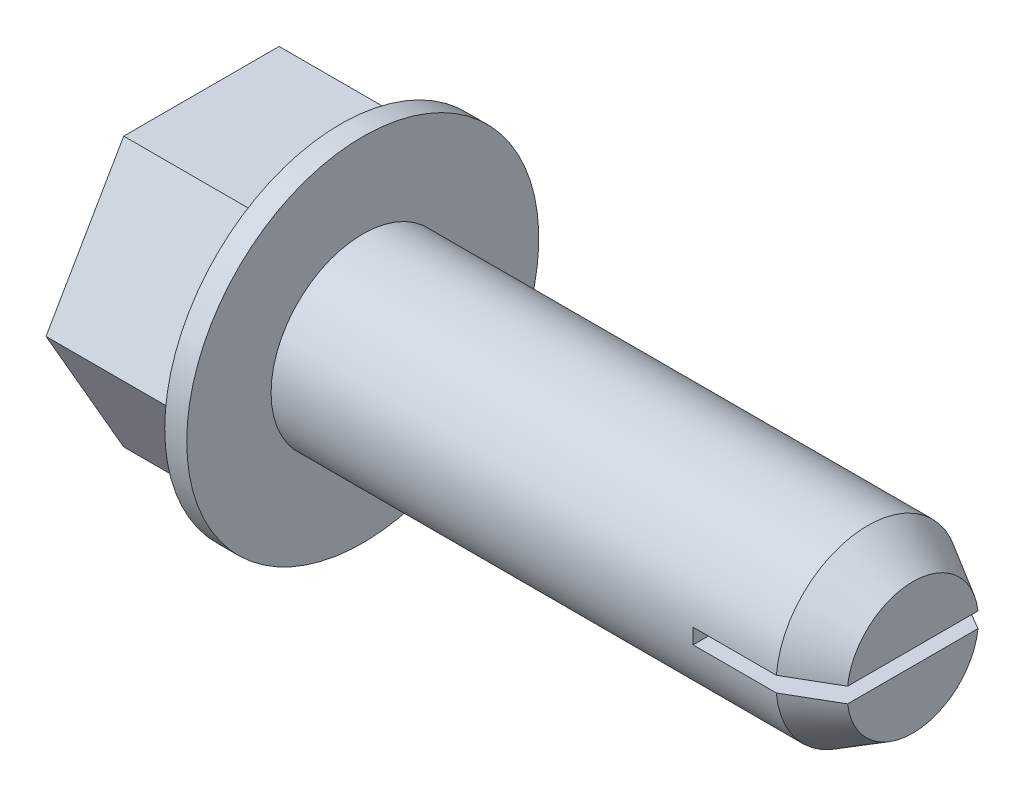
ISO-10303-21;
HEADER;
FILE_DESCRIPTION(('STEP AP214'),'2;1');
FILE_NAME('part.step','',(''),(''),'','','');
FILE_SCHEMA(('AUTOMOTIVE_DESIGN { 1 0 10303 214 1 1 1 1 }'));
ENDSEC;
DATA;
#1=APPLICATION_CONTEXT('core data for automotive mechanical design processes');
#2=APPLICATION_PROTOCOL_DEFINITION('international standard','automotive_design',2000,#1);
#3=PRODUCT_CONTEXT('',#1,'mechanical');
#4=PRODUCT('Part','Part','',(#3));
#5=PRODUCT_RELATED_PRODUCT_CATEGORY('part','',(#4));
#6=PRODUCT_DEFINITION_FORMATION('','',#4);
#7=PRODUCT_DEFINITION_CONTEXT('part definition',#1,'design');
#8=PRODUCT_DEFINITION('design','',#6,#7);
#9=PRODUCT_DEFINITION_SHAPE('','',#8);
#10=(LENGTH_UNIT() NAMED_UNIT(*) SI_UNIT(.MILLI.,.METRE.));
#11=(NAMED_UNIT(*) PLANE_ANGLE_UNIT() SI_UNIT($,.RADIAN.));
#12=(NAMED_UNIT(*) SI_UNIT($,.STERADIAN.) SOLID_ANGLE_UNIT());
#13=UNCERTAINTY_MEASURE_WITH_UNIT(LENGTH_MEASURE(1.E-05),#10,'distance_accuracy_value','');
#14=(GEOMETRIC_REPRESENTATION_CONTEXT(3) GLOBAL_UNCERTAINTY_ASSIGNED_CONTEXT((#13)) GLOBAL_UNIT_ASSIGNED_CONTEXT((#10,
#11,#12)) REPRESENTATION_CONTEXT('',''));
#15=CARTESIAN_POINT('',(0.,0.,0.));
#16=DIRECTION('',(0.,0.,1.));
#17=DIRECTION('',(1.,0.,0.));
#18=AXIS2_PLACEMENT_3D('',#15,#16,#17);
#19=CARTESIAN_POINT('',(14.605,-0.264583333333334,-6.096));
#20=DIRECTION('',(0.,-1.,0.));
#21=DIRECTION('',(0.,0.,-1.));
#22=AXIS2_PLACEMENT_3D('',#19,#20,#21);
#23=PLANE('',#22);
#24=CARTESIAN_POINT('',(17.4882097868151,-0.264583333333334,3.16395648827891));
#25=CARTESIAN_POINT('',(18.0089885370992,-0.264583333333334,2.86223526832155));
#26=CARTESIAN_POINT('',(18.5296581049854,-0.264583333333334,2.56032561142075));
#27=CARTESIAN_POINT('',(19.05,-0.264583333333334,2.25785042678257));
#28=B_SPLINE_CURVE_WITH_KNOTS('',3,(#24,#25,#26,#27),.UNSPECIFIED.,.F.,.F.,(4,4),
(0.00453305455754315,0.0063386613276139),.UNSPECIFIED.);
#29=CARTESIAN_POINT('',(17.4882097868151,-0.264583333333334,3.16395648827891));
#30=VERTEX_POINT('',#29);
#31=CARTESIAN_POINT('',(19.05,-0.264583333333334,2.25785042678257));
#32=VERTEX_POINT('',#31);
#33=EDGE_CURVE('E277',#30,#32,#28,.T.);
#34=ORIENTED_EDGE('',*,*,#33,.T.);
#35=DIRECTION('',(0.,0.,1.));
#36=VECTOR('',#35,1.);
#37=CARTESIAN_POINT('',(19.05,-0.264583333333334,0.));
#38=LINE('',#37,#36);
#39=CARTESIAN_POINT('',(19.05,-0.264583333333334,-2.25785042678257));
#40=VERTEX_POINT('',#39);
#41=EDGE_CURVE('E43',#40,#32,#38,.T.);
#42=ORIENTED_EDGE('',*,*,#41,.F.);
#43=CARTESIAN_POINT('',(19.05,-0.264583333333334,-2.25785042678257));
#44=CARTESIAN_POINT('',(18.5296592052055,-0.264583333333334,-2.56032497186193));
#45=CARTESIAN_POINT('',(18.0089893235556,-0.264583333333334,-2.86223481267582));
#46=CARTESIAN_POINT('',(17.4882097868151,-0.264583333333334,-3.16395648827891));
#47=B_SPLINE_CURVE_WITH_KNOTS('',3,(#43,#44,#45,#46),.UNSPECIFIED.,.F.,.F.,(4,4),
(0.0147270207009754,0.0165431508435462),.UNSPECIFIED.);
#48=CARTESIAN_POINT('',(17.4882097868151,-0.264583333333334,-3.16395648827891));
#49=VERTEX_POINT('',#48);
#50=EDGE_CURVE('E285',#40,#49,#47,.T.);
#51=ORIENTED_EDGE('',*,*,#50,.T.);
#52=DIRECTION('',(1.,0.,0.));
#53=VECTOR('',#52,1.);
#54=CARTESIAN_POINT('',(0.,-0.264583333333333,-3.16395648827891));
#55=LINE('',#54,#53);
#56=CARTESIAN_POINT('',(14.605,-0.264583333333334,-3.16395648827891));
#57=VERTEX_POINT('',#56);
#58=EDGE_CURVE('E220',#57,#49,#55,.T.);
#59=ORIENTED_EDGE('',*,*,#58,.F.);
#60=DIRECTION('',(0.,0.,1.));
#61=VECTOR('',#60,1.);
#62=CARTESIAN_POINT('',(14.605,-0.264583333333334,-6.096));
#63=LINE('',#62,#61);
#64=CARTESIAN_POINT('',(14.605,-0.264583333333334,3.16395648827891));
#65=VERTEX_POINT('',#64);
#66=EDGE_CURVE('E11',#57,#65,#63,.T.);
#67=ORIENTED_EDGE('',*,*,#66,.T.);
#68=DIRECTION('',(-1.,0.,0.));
#69=VECTOR('',#68,1.);
#70=CARTESIAN_POINT('',(0.,-0.264583333333333,3.16395648827891));
#71=LINE('',#70,#69);
#72=EDGE_CURVE('E170',#30,#65,#71,.T.);
#73=ORIENTED_EDGE('',*,*,#72,.F.);
#74=EDGE_LOOP('',(#34,#42,#51,#59,#67,#73));
#75=FACE_BOUND('',#74,.T.);
#76=ADVANCED_FACE('F17',(#75),#23,.F.);
#77=CARTESIAN_POINT('',(14.605,0.264583333333334,-6.096));
#78=DIRECTION('',(0.,1.,0.));
#79=DIRECTION('',(1.,0.,0.));
#80=AXIS2_PLACEMENT_3D('',#77,#78,#79);
#81=PLANE('',#80);
#82=CARTESIAN_POINT('',(17.4882097868151,0.264583333333334,-3.16395648827891));
#83=CARTESIAN_POINT('',(18.0089885370992,0.264583333333334,-2.86223526832155));
#84=CARTESIAN_POINT('',(18.5296581049854,0.264583333333334,-2.56032561142075));
#85=CARTESIAN_POINT('',(19.05,0.264583333333334,-2.25785042678257));
#86=B_SPLINE_CURVE_WITH_KNOTS('',3,(#82,#83,#84,#85),.UNSPECIFIED.,.F.,.F.,(4,4),
(0.00453305455754315,0.0063386613276139),.UNSPECIFIED.);
#87=CARTESIAN_POINT('',(17.4882097868151,0.264583333333334,-3.16395648827891));
#88=VERTEX_POINT('',#87);
#89=CARTESIAN_POINT('',(19.05,0.264583333333334,-2.25785042678257));
#90=VERTEX_POINT('',#89);
#91=EDGE_CURVE('E21',#88,#90,#86,.T.);
#92=ORIENTED_EDGE('',*,*,#91,.T.);
#93=DIRECTION('',(0.,0.,-1.));
#94=VECTOR('',#93,1.);
#95=CARTESIAN_POINT('',(19.05,0.264583333333334,0.));
#96=LINE('',#95,#94);
#97=CARTESIAN_POINT('',(19.05,0.264583333333334,2.25785042678257));
#98=VERTEX_POINT('',#97);
#99=EDGE_CURVE('E215',#98,#90,#96,.T.);
#100=ORIENTED_EDGE('',*,*,#99,.F.);
#101=CARTESIAN_POINT('',(19.05,0.264583333333334,2.25785042678257));
#102=CARTESIAN_POINT('',(18.5296592052055,0.264583333333334,2.56032497186193));
#103=CARTESIAN_POINT('',(18.0089893235556,0.264583333333334,2.86223481267582));
#104=CARTESIAN_POINT('',(17.4882097868151,0.264583333333334,3.16395648827891));
#105=B_SPLINE_CURVE_WITH_KNOTS('',3,(#101,#102,#103,#104),.UNSPECIFIED.,.F.,.F.,(4,4),
(0.0147270207009754,0.0165431508435462),.UNSPECIFIED.);
#106=CARTESIAN_POINT('',(17.4882097868151,0.264583333333334,3.16395648827891));
#107=VERTEX_POINT('',#106);
#108=EDGE_CURVE('E158',#98,#107,#105,.T.);
#109=ORIENTED_EDGE('',*,*,#108,.T.);
#110=DIRECTION('',(1.,0.,0.));
#111=VECTOR('',#110,1.);
#112=CARTESIAN_POINT('',(0.,0.264583333333333,3.16395648827891));
#113=LINE('',#112,#111);
#114=CARTESIAN_POINT('',(14.605,0.264583333333334,3.16395648827891));
#115=VERTEX_POINT('',#114);
#116=EDGE_CURVE('E151',#115,#107,#113,.T.);
#117=ORIENTED_EDGE('',*,*,#116,.F.);
#118=DIRECTION('',(0.,0.,1.));
#119=VECTOR('',#118,1.);
#120=CARTESIAN_POINT('',(14.605,0.264583333333334,-6.096));
#121=LINE('',#120,#119);
#122=CARTESIAN_POINT('',(14.605,0.264583333333334,-3.16395648827891));
#123=VERTEX_POINT('',#122);
#124=EDGE_CURVE('E26',#123,#115,#121,.T.);
#125=ORIENTED_EDGE('',*,*,#124,.F.);
#126=DIRECTION('',(-1.,0.,0.));
#127=VECTOR('',#126,1.);
#128=CARTESIAN_POINT('',(0.,0.264583333333333,-3.16395648827891));
#129=LINE('',#128,#127);
#130=EDGE_CURVE('E204',#88,#123,#129,.T.);
#131=ORIENTED_EDGE('',*,*,#130,.F.);
#132=EDGE_LOOP('',(#92,#100,#109,#117,#125,#131));
#133=FACE_BOUND('',#132,.T.);
#134=ADVANCED_FACE('F19',(#133),#81,.F.);
#135=CARTESIAN_POINT('',(14.605,0.264583333333334,-6.096));
#136=DIRECTION('',(-1.,0.,0.));
#137=DIRECTION('',(0.,0.,1.));
#138=AXIS2_PLACEMENT_3D('',#135,#136,#137);
#139=PLANE('',#138);
#140=ORIENTED_EDGE('',*,*,#124,.T.);
#141=CARTESIAN_POINT('',(14.605,0.,0.));
#142=DIRECTION('',(-1.,0.,0.));
#143=DIRECTION('',(0.,0.,1.));
#144=AXIS2_PLACEMENT_3D('',#141,#142,#143);
#145=CIRCLE('',#144,3.175);
#146=EDGE_CURVE('E144',#65,#115,#145,.T.);
#147=ORIENTED_EDGE('',*,*,#146,.F.);
#148=ORIENTED_EDGE('',*,*,#66,.F.);
#149=CARTESIAN_POINT('',(14.605,0.,0.));
#150=DIRECTION('',(-1.,0.,0.));
#151=DIRECTION('',(0.,0.,1.));
#152=AXIS2_PLACEMENT_3D('',#149,#150,#151);
#153=CIRCLE('',#152,3.175);
#154=EDGE_CURVE('E148',#123,#57,#153,.T.);
#155=ORIENTED_EDGE('',*,*,#154,.F.);
#156=EDGE_LOOP('',(#140,#147,#148,#155));
#157=FACE_BOUND('',#156,.T.);
#158=ADVANCED_FACE('F145',(#157),#139,.F.);
#159=CARTESIAN_POINT('',(19.05,3.175,0.));
#160=DIRECTION('',(-1.,0.,0.));
#161=DIRECTION('',(0.,0.,1.));
#162=AXIS2_PLACEMENT_3D('',#159,#160,#161);
#163=PLANE('',#162);
#164=CARTESIAN_POINT('',(19.05,0.,0.));
#165=DIRECTION('',(-1.,0.,0.));
#166=DIRECTION('',(0.,0.,1.));
#167=AXIS2_PLACEMENT_3D('',#164,#165,#166);
#168=CIRCLE('',#167,2.2733);
#169=EDGE_CURVE('E221',#40,#32,#168,.T.);
#170=ORIENTED_EDGE('',*,*,#169,.F.);
#171=ORIENTED_EDGE('',*,*,#41,.T.);
#172=EDGE_LOOP('',(#170,#171));
#173=FACE_BOUND('',#172,.T.);
#174=ADVANCED_FACE('F362',(#173),#163,.F.);
#175=CARTESIAN_POINT('',(17.4882097868151,0.,0.));
#176=DIRECTION('',(-1.,0.,0.));
#177=DIRECTION('',(0.,0.,1.));
#178=AXIS2_PLACEMENT_3D('',#175,#176,#177);
#179=CONICAL_SURFACE('',#178,3.175,0.523598775598292);
#180=ORIENTED_EDGE('',*,*,#33,.F.);
#181=CARTESIAN_POINT('',(17.4882097868151,0.,0.));
#182=DIRECTION('',(-1.,0.,0.));
#183=DIRECTION('',(0.,0.,1.));
#184=AXIS2_PLACEMENT_3D('',#181,#182,#183);
#185=CIRCLE('',#184,3.175);
#186=EDGE_CURVE('E205',#49,#30,#185,.T.);
#187=ORIENTED_EDGE('',*,*,#186,.F.);
#188=ORIENTED_EDGE('',*,*,#50,.F.);
#189=ORIENTED_EDGE('',*,*,#169,.T.);
#190=EDGE_LOOP('',(#180,#187,#188,#189));
#191=FACE_BOUND('',#190,.T.);
#192=ADVANCED_FACE('F358',(#191),#179,.T.);
#193=CARTESIAN_POINT('',(500000.,-4.6609,0.));
#194=DIRECTION('',(0.,-1.,0.));
#195=DIRECTION('',(0.,0.,-1.));
#196=AXIS2_PLACEMENT_3D('',#193,#194,#195);
#197=PLANE('',#196);
#198=DIRECTION('',(0.,0.,1.));
#199=VECTOR('',#198,1.);
#200=CARTESIAN_POINT('',(-5.588,-4.6609,0.));
#201=LINE('',#200,#199);
#202=CARTESIAN_POINT('',(-5.588,-4.6609,-2.69097186966593));
#203=VERTEX_POINT('',#202);
#204=CARTESIAN_POINT('',(-5.588,-4.6609,2.69097186966593));
#205=VERTEX_POINT('',#204);
#206=EDGE_CURVE('E251',#203,#205,#201,.T.);
#207=ORIENTED_EDGE('',*,*,#206,.F.);
#208=DIRECTION('',(-1.,0.,0.));
#209=VECTOR('',#208,1.);
#210=CARTESIAN_POINT('',(500000.,-4.6609,-2.69097186966593));
#211=LINE('',#210,#209);
#212=CARTESIAN_POINT('',(-0.762,-4.6609,-2.69097186966593));
#213=VERTEX_POINT('',#212);
#214=EDGE_CURVE('E267',#213,#203,#211,.T.);
#215=ORIENTED_EDGE('',*,*,#214,.F.);
#216=DIRECTION('',(0.,0.,1.));
#217=VECTOR('',#216,1.);
#218=CARTESIAN_POINT('',(-0.762000000008811,-4.6609,0.));
#219=LINE('',#218,#217);
#220=CARTESIAN_POINT('',(-0.762,-4.6609,2.69097186966593));
#221=VERTEX_POINT('',#220);
#222=EDGE_CURVE('E201',#213,#221,#219,.T.);
#223=ORIENTED_EDGE('',*,*,#222,.T.);
#224=DIRECTION('',(-1.,0.,0.));
#225=VECTOR('',#224,1.);
#226=CARTESIAN_POINT('',(500000.,-4.6609,2.69097186966593));
#227=LINE('',#226,#225);
#228=EDGE_CURVE('E280',#221,#205,#227,.T.);
#229=ORIENTED_EDGE('',*,*,#228,.T.);
#230=EDGE_LOOP('',(#207,#215,#223,#229));
#231=FACE_BOUND('',#230,.T.);
#232=ADVANCED_FACE('F357',(#231),#197,.T.);
#233=CARTESIAN_POINT('',(500000.,-2.33045,4.03645780449889));
#234=DIRECTION('',(0.,-0.5,0.866025403784439));
#235=DIRECTION('',(-1.,0.,0.));
#236=AXIS2_PLACEMENT_3D('',#233,#234,#235);
#237=PLANE('',#236);
#238=DIRECTION('',(0.,0.866025403784439,0.5));
#239=VECTOR('',#238,1.);
#240=CARTESIAN_POINT('',(-5.588,-2.33045,4.03645780449889));
#241=LINE('',#240,#239);
#242=CARTESIAN_POINT('',(-5.588,0.,5.38194373933185));
#243=VERTEX_POINT('',#242);
#244=EDGE_CURVE('E194',#205,#243,#241,.T.);
#245=ORIENTED_EDGE('',*,*,#244,.F.);
#246=ORIENTED_EDGE('',*,*,#228,.F.);
#247=DIRECTION('',(0.,0.866025403784439,0.5));
#248=VECTOR('',#247,1.);
#249=CARTESIAN_POINT('',(-0.762000000008811,-2.33045,4.03645780449889));
#250=LINE('',#249,#248);
#251=CARTESIAN_POINT('',(-0.762,0.,5.38194373933185));
#252=VERTEX_POINT('',#251);
#253=EDGE_CURVE('E213',#221,#252,#250,.T.);
#254=ORIENTED_EDGE('',*,*,#253,.T.);
#255=DIRECTION('',(-1.,0.,0.));
#256=VECTOR('',#255,1.);
#257=CARTESIAN_POINT('',(500000.,0.,5.38194373933185));
#258=LINE('',#257,#256);
#259=EDGE_CURVE('E275',#252,#243,#258,.T.);
#260=ORIENTED_EDGE('',*,*,#259,.T.);
#261=EDGE_LOOP('',(#245,#246,#254,#260));
#262=FACE_BOUND('',#261,.T.);
#263=ADVANCED_FACE('F355',(#262),#237,.T.);
#264=CARTESIAN_POINT('',(500000.,2.33045,4.03645780449889));
#265=DIRECTION('',(0.,0.5,0.866025403784439));
#266=DIRECTION('',(1.,0.,0.));
#267=AXIS2_PLACEMENT_3D('',#264,#265,#266);
#268=PLANE('',#267);
#269=DIRECTION('',(0.,0.866025403784439,-0.5));
#270=VECTOR('',#269,1.);
#271=CARTESIAN_POINT('',(-5.588,2.33045,4.03645780449889));
#272=LINE('',#271,#270);
#273=CARTESIAN_POINT('',(-5.588,4.6609,2.69097186966593));
#274=VERTEX_POINT('',#273);
#275=EDGE_CURVE('E189',#243,#274,#272,.T.);
#276=ORIENTED_EDGE('',*,*,#275,.F.);
#277=ORIENTED_EDGE('',*,*,#259,.F.);
#278=DIRECTION('',(0.,0.866025403784439,-0.5));
#279=VECTOR('',#278,1.);
#280=CARTESIAN_POINT('',(-0.762000000008811,2.33045,4.03645780449889));
#281=LINE('',#280,#279);
#282=CARTESIAN_POINT('',(-0.762,4.6609,2.69097186966593));
#283=VERTEX_POINT('',#282);
#284=EDGE_CURVE('E207',#252,#283,#281,.T.);
#285=ORIENTED_EDGE('',*,*,#284,.T.);
#286=DIRECTION('',(-1.,0.,0.));
#287=VECTOR('',#286,1.);
#288=CARTESIAN_POINT('',(500000.,4.6609,2.69097186966593));
#289=LINE('',#288,#287);
#290=EDGE_CURVE('E273',#283,#274,#289,.T.);
#291=ORIENTED_EDGE('',*,*,#290,.T.);
#292=EDGE_LOOP('',(#276,#277,#285,#291));
#293=FACE_BOUND('',#292,.T.);
#294=ADVANCED_FACE('F342',(#293),#268,.T.);
#295=CARTESIAN_POINT('',(500000.,4.6609,0.));
#296=DIRECTION('',(0.,1.,0.));
#297=DIRECTION('',(1.,0.,0.));
#298=AXIS2_PLACEMENT_3D('',#295,#296,#297);
#299=PLANE('',#298);
#300=DIRECTION('',(0.,0.,-1.));
#301=VECTOR('',#300,1.);
#302=CARTESIAN_POINT('',(-5.588,4.6609,0.));
#303=LINE('',#302,#301);
#304=CARTESIAN_POINT('',(-5.588,4.6609,-2.69097186966593));
#305=VERTEX_POINT('',#304);
#306=EDGE_CURVE('E192',#274,#305,#303,.T.);
#307=ORIENTED_EDGE('',*,*,#306,.F.);
#308=ORIENTED_EDGE('',*,*,#290,.F.);
#309=DIRECTION('',(0.,0.,-1.));
#310=VECTOR('',#309,1.);
#311=CARTESIAN_POINT('',(-0.762000000008811,4.6609,0.));
#312=LINE('',#311,#310);
#313=CARTESIAN_POINT('',(-0.762,4.6609,-2.69097186966593));
#314=VERTEX_POINT('',#313);
#315=EDGE_CURVE('E212',#283,#314,#312,.T.);
#316=ORIENTED_EDGE('',*,*,#315,.T.);
#317=DIRECTION('',(-1.,0.,0.));
#318=VECTOR('',#317,1.);
#319=CARTESIAN_POINT('',(500000.,4.6609,-2.69097186966593));
#320=LINE('',#319,#318);
#321=EDGE_CURVE('E265',#314,#305,#320,.T.);
#322=ORIENTED_EDGE('',*,*,#321,.T.);
#323=EDGE_LOOP('',(#307,#308,#316,#322));
#324=FACE_BOUND('',#323,.T.);
#325=ADVANCED_FACE('F337',(#324),#299,.T.);
#326=CARTESIAN_POINT('',(500000.,-2.33045,-4.03645780449889));
#327=DIRECTION('',(0.,-0.5,-0.866025403784439));
#328=DIRECTION('',(0.,-0.866025403784439,0.5));
#329=AXIS2_PLACEMENT_3D('',#326,#327,#328);
#330=PLANE('',#329);
#331=DIRECTION('',(-1.,0.,0.));
#332=VECTOR('',#331,1.);
#333=CARTESIAN_POINT('',(500000.,0.,-5.38194373933185));
#334=LINE('',#333,#332);
#335=CARTESIAN_POINT('',(-0.761999999895125,0.,-5.38194373933185));
#336=VERTEX_POINT('',#335);
#337=CARTESIAN_POINT('',(-5.588,0.,-5.38194373933185));
#338=VERTEX_POINT('',#337);
#339=EDGE_CURVE('E264',#336,#338,#334,.T.);
#340=ORIENTED_EDGE('',*,*,#339,.F.);
#341=DIRECTION('',(0.,-0.866025403784439,0.5));
#342=VECTOR('',#341,1.);
#343=CARTESIAN_POINT('',(-0.762000000008811,-2.33045,-4.03645780449889));
#344=LINE('',#343,#342);
#345=EDGE_CURVE('E229',#336,#213,#344,.T.);
#346=ORIENTED_EDGE('',*,*,#345,.T.);
#347=ORIENTED_EDGE('',*,*,#214,.T.);
#348=DIRECTION('',(0.,-0.866025403784439,0.5));
#349=VECTOR('',#348,1.);
#350=CARTESIAN_POINT('',(-5.588,-2.33045,-4.03645780449889));
#351=LINE('',#350,#349);
#352=EDGE_CURVE('E250',#338,#203,#351,.T.);
#353=ORIENTED_EDGE('',*,*,#352,.F.);
#354=EDGE_LOOP('',(#340,#346,#347,#353));
#355=FACE_BOUND('',#354,.T.);
#356=ADVANCED_FACE('F343',(#355),#330,.T.);
#357=CARTESIAN_POINT('',(500000.,2.33045,-4.03645780449889));
#358=DIRECTION('',(0.,0.5,-0.866025403784439));
#359=DIRECTION('',(-1.,0.,0.));
#360=AXIS2_PLACEMENT_3D('',#357,#358,#359);
#361=PLANE('',#360);
#362=DIRECTION('',(0.,-0.866025403784439,-0.5));
#363=VECTOR('',#362,1.);
#364=CARTESIAN_POINT('',(-5.588,2.33045,-4.03645780449889));
#365=LINE('',#364,#363);
#366=EDGE_CURVE('E239',#305,#338,#365,.T.);
#367=ORIENTED_EDGE('',*,*,#366,.F.);
#368=ORIENTED_EDGE('',*,*,#321,.F.);
#369=DIRECTION('',(0.,-0.866025403784439,-0.5));
#370=VECTOR('',#369,1.);
#371=CARTESIAN_POINT('',(-0.762000000008811,2.33045,-4.03645780449889));
#372=LINE('',#371,#370);
#373=EDGE_CURVE('E233',#314,#336,#372,.T.);
#374=ORIENTED_EDGE('',*,*,#373,.T.);
#375=ORIENTED_EDGE('',*,*,#339,.T.);
#376=EDGE_LOOP('',(#367,#368,#374,#375));
#377=FACE_BOUND('',#376,.T.);
#378=ADVANCED_FACE('F348',(#377),#361,.T.);
#379=CARTESIAN_POINT('',(-5.588,4.6609,0.));
#380=DIRECTION('',(1.,0.,0.));
#381=DIRECTION('',(0.,1.,0.));
#382=AXIS2_PLACEMENT_3D('',#379,#380,#381);
#383=PLANE('',#382);
#384=CARTESIAN_POINT('',(-5.588,0.,0.));
#385=DIRECTION('',(-1.,0.,0.));
#386=DIRECTION('',(0.,0.,1.));
#387=AXIS2_PLACEMENT_3D('',#384,#385,#386);
#388=CIRCLE('',#387,3.72872);
#389=CARTESIAN_POINT('',(-5.588,0.,3.72872));
#390=VERTEX_POINT('',#389);
#391=EDGE_CURVE('E185',#390,#390,#388,.T.);
#392=ORIENTED_EDGE('',*,*,#391,.F.);
#393=EDGE_LOOP('',(#392));
#394=FACE_BOUND('',#393,.T.);
#395=ORIENTED_EDGE('',*,*,#352,.T.);
#396=ORIENTED_EDGE('',*,*,#206,.T.);
#397=ORIENTED_EDGE('',*,*,#244,.T.);
#398=ORIENTED_EDGE('',*,*,#275,.T.);
#399=ORIENTED_EDGE('',*,*,#306,.T.);
#400=ORIENTED_EDGE('',*,*,#366,.T.);
#401=EDGE_LOOP('',(#395,#396,#397,#398,#399,#400));
#402=FACE_BOUND('',#401,.T.);
#403=ADVANCED_FACE('F336',(#394,#402),#383,.F.);
#404=CARTESIAN_POINT('',(-0.762,6.096,0.));
#405=DIRECTION('',(1.,0.,0.));
#406=DIRECTION('',(0.,1.,0.));
#407=AXIS2_PLACEMENT_3D('',#404,#405,#406);
#408=PLANE('',#407);
#409=ORIENTED_EDGE('',*,*,#222,.F.);
#410=ORIENTED_EDGE('',*,*,#345,.F.);
#411=ORIENTED_EDGE('',*,*,#373,.F.);
#412=ORIENTED_EDGE('',*,*,#315,.F.);
#413=ORIENTED_EDGE('',*,*,#284,.F.);
#414=ORIENTED_EDGE('',*,*,#253,.F.);
#415=EDGE_LOOP('',(#409,#410,#411,#412,#413,#414));
#416=FACE_BOUND('',#415,.T.);
#417=CARTESIAN_POINT('',(-0.762,0.,0.));
#418=DIRECTION('',(-1.,0.,0.));
#419=DIRECTION('',(0.,0.,1.));
#420=AXIS2_PLACEMENT_3D('',#417,#418,#419);
#421=CIRCLE('',#420,6.096);
#422=CARTESIAN_POINT('',(-0.762,0.,6.096));
#423=VERTEX_POINT('',#422);
#424=EDGE_CURVE('E183',#423,#423,#421,.T.);
#425=ORIENTED_EDGE('',*,*,#424,.T.);
#426=EDGE_LOOP('',(#425));
#427=FACE_BOUND('',#426,.T.);
#428=ADVANCED_FACE('F425',(#416,#427),#408,.F.);
#429=CARTESIAN_POINT('',(0.,3.175,0.));
#430=DIRECTION('',(-1.,0.,0.));
#431=DIRECTION('',(0.,0.,1.));
#432=AXIS2_PLACEMENT_3D('',#429,#430,#431);
#433=PLANE('',#432);
#434=CARTESIAN_POINT('',(0.,0.,0.));
#435=DIRECTION('',(-1.,0.,0.));
#436=DIRECTION('',(0.,0.,1.));
#437=AXIS2_PLACEMENT_3D('',#434,#435,#436);
#438=CIRCLE('',#437,3.175);
#439=CARTESIAN_POINT('',(0.,0.,3.175));
#440=VERTEX_POINT('',#439);
#441=EDGE_CURVE('E167',#440,#440,#438,.T.);
#442=ORIENTED_EDGE('',*,*,#441,.T.);
#443=EDGE_LOOP('',(#442));
#444=FACE_BOUND('',#443,.T.);
#445=CARTESIAN_POINT('',(0.,0.,0.));
#446=DIRECTION('',(-1.,0.,0.));
#447=DIRECTION('',(0.,0.,1.));
#448=AXIS2_PLACEMENT_3D('',#445,#446,#447);
#449=CIRCLE('',#448,6.096);
#450=CARTESIAN_POINT('',(0.,0.,6.096));
#451=VERTEX_POINT('',#450);
#452=EDGE_CURVE('E178',#451,#451,#449,.T.);
#453=ORIENTED_EDGE('',*,*,#452,.F.);
#454=EDGE_LOOP('',(#453));
#455=FACE_BOUND('',#454,.T.);
#456=ADVANCED_FACE('F328',(#444,#455),#433,.F.);
#457=CARTESIAN_POINT('',(-4.6228,3.72872,0.));
#458=DIRECTION('',(1.,0.,0.));
#459=DIRECTION('',(0.,1.,0.));
#460=AXIS2_PLACEMENT_3D('',#457,#458,#459);
#461=PLANE('',#460);
#462=CARTESIAN_POINT('',(-4.6228,0.,0.));
#463=DIRECTION('',(-1.,0.,0.));
#464=DIRECTION('',(0.,0.,1.));
#465=AXIS2_PLACEMENT_3D('',#462,#463,#464);
#466=CIRCLE('',#465,3.72872);
#467=CARTESIAN_POINT('',(-4.6228,0.,3.72872));
#468=VERTEX_POINT('',#467);
#469=EDGE_CURVE('E187',#468,#468,#466,.T.);
#470=ORIENTED_EDGE('',*,*,#469,.T.);
#471=EDGE_LOOP('',(#470));
#472=FACE_BOUND('',#471,.T.);
#473=ADVANCED_FACE('F319',(#472),#461,.F.);
#474=CARTESIAN_POINT('',(19.05,3.175,0.));
#475=DIRECTION('',(-1.,0.,0.));
#476=DIRECTION('',(0.,0.,1.));
#477=AXIS2_PLACEMENT_3D('',#474,#475,#476);
#478=PLANE('',#477);
#479=CARTESIAN_POINT('',(19.05,0.,0.));
#480=DIRECTION('',(-1.,0.,0.));
#481=DIRECTION('',(0.,0.,1.));
#482=AXIS2_PLACEMENT_3D('',#479,#480,#481);
#483=CIRCLE('',#482,2.2733);
#484=EDGE_CURVE('E216',#98,#90,#483,.T.);
#485=ORIENTED_EDGE('',*,*,#484,.F.);
#486=ORIENTED_EDGE('',*,*,#99,.T.);
#487=EDGE_LOOP('',(#485,#486));
#488=FACE_BOUND('',#487,.T.);
#489=ADVANCED_FACE('F317',(#488),#478,.F.);
#490=CARTESIAN_POINT('',(17.4882097868151,0.,0.));
#491=DIRECTION('',(-1.,0.,0.));
#492=DIRECTION('',(0.,0.,1.));
#493=AXIS2_PLACEMENT_3D('',#490,#491,#492);
#494=CONICAL_SURFACE('',#493,3.175,0.523598775598292);
#495=ORIENTED_EDGE('',*,*,#91,.F.);
#496=CARTESIAN_POINT('',(17.4882097868151,0.,0.));
#497=DIRECTION('',(-1.,0.,0.));
#498=DIRECTION('',(0.,0.,1.));
#499=AXIS2_PLACEMENT_3D('',#496,#497,#498);
#500=CIRCLE('',#499,3.175);
#501=EDGE_CURVE('E161',#107,#88,#500,.T.);
#502=ORIENTED_EDGE('',*,*,#501,.F.);
#503=ORIENTED_EDGE('',*,*,#108,.F.);
#504=ORIENTED_EDGE('',*,*,#484,.T.);
#505=EDGE_LOOP('',(#495,#502,#503,#504));
#506=FACE_BOUND('',#505,.T.);
#507=ADVANCED_FACE('F312',(#506),#494,.T.);
#508=CARTESIAN_POINT('',(0.,0.,0.));
#509=DIRECTION('',(-1.,0.,0.));
#510=DIRECTION('',(0.,0.,1.));
#511=AXIS2_PLACEMENT_3D('',#508,#509,#510);
#512=CYLINDRICAL_SURFACE('',#511,3.175);
#513=ORIENTED_EDGE('',*,*,#441,.F.);
#514=EDGE_LOOP('',(#513));
#515=FACE_BOUND('',#514,.T.);
#516=ORIENTED_EDGE('',*,*,#154,.T.);
#517=ORIENTED_EDGE('',*,*,#58,.T.);
#518=ORIENTED_EDGE('',*,*,#186,.T.);
#519=ORIENTED_EDGE('',*,*,#72,.T.);
#520=ORIENTED_EDGE('',*,*,#146,.T.);
#521=ORIENTED_EDGE('',*,*,#116,.T.);
#522=ORIENTED_EDGE('',*,*,#501,.T.);
#523=ORIENTED_EDGE('',*,*,#130,.T.);
#524=EDGE_LOOP('',(#516,#517,#518,#519,#520,#521,#522,#523));
#525=FACE_BOUND('',#524,.T.);
#526=ADVANCED_FACE('F162',(#515,#525),#512,.T.);
#527=CARTESIAN_POINT('',(0.,0.,0.));
#528=DIRECTION('',(-1.,0.,0.));
#529=DIRECTION('',(0.,0.,1.));
#530=AXIS2_PLACEMENT_3D('',#527,#528,#529);
#531=CYLINDRICAL_SURFACE('',#530,6.096);
#532=ORIENTED_EDGE('',*,*,#424,.F.);
#533=EDGE_LOOP('',(#532));
#534=FACE_BOUND('',#533,.T.);
#535=ORIENTED_EDGE('',*,*,#452,.T.);
#536=EDGE_LOOP('',(#535));
#537=FACE_BOUND('',#536,.T.);
#538=ADVANCED_FACE('F471',(#534,#537),#531,.T.);
#539=CARTESIAN_POINT('',(0.,0.,0.));
#540=DIRECTION('',(-1.,0.,0.));
#541=DIRECTION('',(0.,0.,1.));
#542=AXIS2_PLACEMENT_3D('',#539,#540,#541);
#543=CYLINDRICAL_SURFACE('',#542,3.72872);
#544=ORIENTED_EDGE('',*,*,#391,.T.);
#545=EDGE_LOOP('',(#544));
#546=FACE_BOUND('',#545,.T.);
#547=ORIENTED_EDGE('',*,*,#469,.F.);
#548=EDGE_LOOP('',(#547));
#549=FACE_BOUND('',#548,.T.);
#550=ADVANCED_FACE('F481',(#546,#549),#543,.F.);
#551=CLOSED_SHELL('',(#76,#134,#158,#174,#192,#232,#263,#294,#325,#356,#378,#403,#428,#456,#473,
#489,#507,#526,#538,#550));
#552=MANIFOLD_SOLID_BREP('B1',#551);
#553=ADVANCED_BREP_SHAPE_REPRESENTATION('',(#18,#552),#14);
#554=SHAPE_DEFINITION_REPRESENTATION(#9,#553);
ENDSEC;
END-ISO-10303-21;
